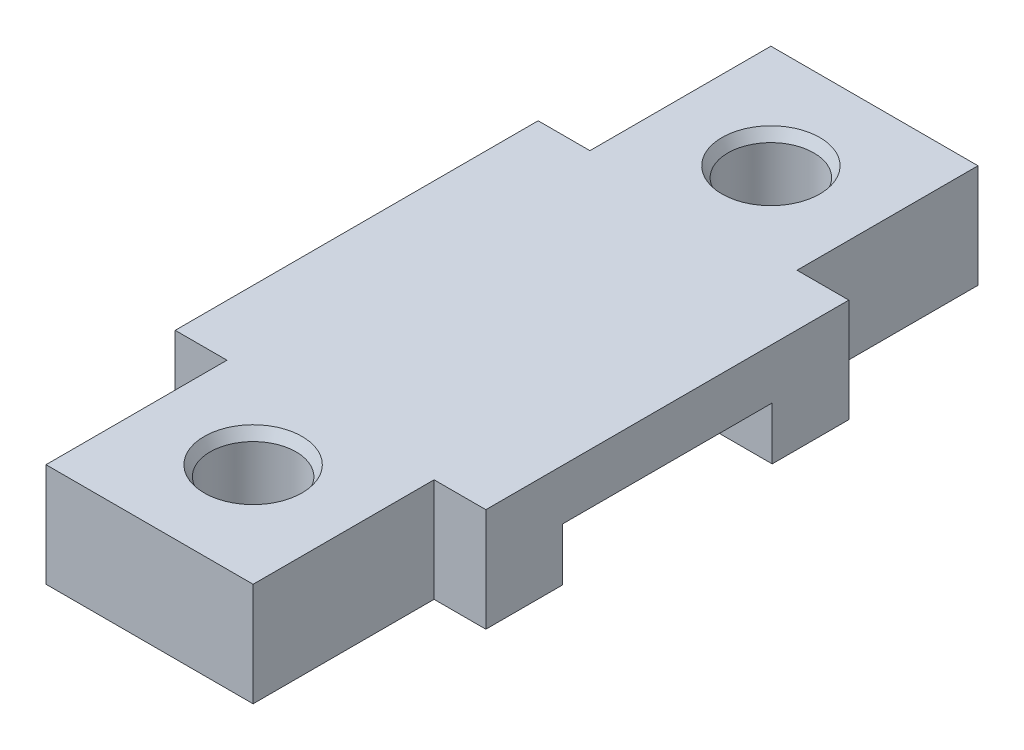
ISO-10303-21;
HEADER;
FILE_DESCRIPTION(('STEP AP214'),'2;1');
FILE_NAME('part.step','',(''),(''),'','','');
FILE_SCHEMA(('AUTOMOTIVE_DESIGN { 1 0 10303 214 1 1 1 1 }'));
ENDSEC;
DATA;
#1=APPLICATION_CONTEXT('core data for automotive mechanical design processes');
#2=APPLICATION_PROTOCOL_DEFINITION('international standard','automotive_design',2000,#1);
#3=PRODUCT_CONTEXT('',#1,'mechanical');
#4=PRODUCT('Part','Part','',(#3));
#5=PRODUCT_RELATED_PRODUCT_CATEGORY('part','',(#4));
#6=PRODUCT_DEFINITION_FORMATION('','',#4);
#7=PRODUCT_DEFINITION_CONTEXT('part definition',#1,'design');
#8=PRODUCT_DEFINITION('design','',#6,#7);
#9=PRODUCT_DEFINITION_SHAPE('','',#8);
#10=(LENGTH_UNIT() NAMED_UNIT(*) SI_UNIT(.MILLI.,.METRE.));
#11=(NAMED_UNIT(*) PLANE_ANGLE_UNIT() SI_UNIT($,.RADIAN.));
#12=(NAMED_UNIT(*) SI_UNIT($,.STERADIAN.) SOLID_ANGLE_UNIT());
#13=UNCERTAINTY_MEASURE_WITH_UNIT(LENGTH_MEASURE(1.E-05),#10,'distance_accuracy_value','');
#14=(GEOMETRIC_REPRESENTATION_CONTEXT(3) GLOBAL_UNCERTAINTY_ASSIGNED_CONTEXT((#13)) GLOBAL_UNIT_ASSIGNED_CONTEXT((#10,
#11,#12)) REPRESENTATION_CONTEXT('',''));
#15=CARTESIAN_POINT('',(0.,0.,0.));
#16=DIRECTION('',(0.,0.,1.));
#17=DIRECTION('',(1.,0.,0.));
#18=AXIS2_PLACEMENT_3D('',#15,#16,#17);
#19=CARTESIAN_POINT('',(-10.,10.,35.));
#20=DIRECTION('',(1.,0.,0.));
#21=DIRECTION('',(0.,0.,-1.));
#22=AXIS2_PLACEMENT_3D('',#19,#20,#21);
#23=PLANE('',#22);
#24=DIRECTION('',(0.,0.,1.));
#25=VECTOR('',#24,1.);
#26=CARTESIAN_POINT('',(-10.,10.,35.));
#27=LINE('',#26,#25);
#28=CARTESIAN_POINT('',(-10.,10.,17.525));
#29=VERTEX_POINT('',#28);
#30=CARTESIAN_POINT('',(-10.,10.,35.));
#31=VERTEX_POINT('',#30);
#32=EDGE_CURVE('E248',#29,#31,#27,.T.);
#33=ORIENTED_EDGE('',*,*,#32,.F.);
#34=DIRECTION('',(0.,-1.,0.));
#35=VECTOR('',#34,1.);
#36=CARTESIAN_POINT('',(-10.,10.,17.525));
#37=LINE('',#36,#35);
#38=CARTESIAN_POINT('',(-10.,0.,17.525));
#39=VERTEX_POINT('',#38);
#40=EDGE_CURVE('E49',#29,#39,#37,.T.);
#41=ORIENTED_EDGE('',*,*,#40,.T.);
#42=DIRECTION('',(0.,0.,1.));
#43=VECTOR('',#42,1.);
#44=CARTESIAN_POINT('',(-10.,0.,35.));
#45=LINE('',#44,#43);
#46=CARTESIAN_POINT('',(-10.,0.,35.));
#47=VERTEX_POINT('',#46);
#48=EDGE_CURVE('E158',#39,#47,#45,.T.);
#49=ORIENTED_EDGE('',*,*,#48,.T.);
#50=DIRECTION('',(0.,-1.,0.));
#51=VECTOR('',#50,1.);
#52=CARTESIAN_POINT('',(-10.,10.,35.));
#53=LINE('',#52,#51);
#54=EDGE_CURVE('E272',#31,#47,#53,.T.);
#55=ORIENTED_EDGE('',*,*,#54,.F.);
#56=EDGE_LOOP('',(#33,#41,#49,#55));
#57=FACE_BOUND('',#56,.T.);
#58=ADVANCED_FACE('F34',(#57),#23,.F.);
#59=CARTESIAN_POINT('',(9.99999999999999,10.,35.));
#60=DIRECTION('',(-1.,0.,0.));
#61=DIRECTION('',(0.,0.,1.));
#62=AXIS2_PLACEMENT_3D('',#59,#60,#61);
#63=PLANE('',#62);
#64=DIRECTION('',(0.,0.,-1.));
#65=VECTOR('',#64,1.);
#66=CARTESIAN_POINT('',(9.99999999999999,0.,35.));
#67=LINE('',#66,#65);
#68=CARTESIAN_POINT('',(9.99999999999999,0.,35.));
#69=VERTEX_POINT('',#68);
#70=CARTESIAN_POINT('',(9.99999999999999,0.,17.525));
#71=VERTEX_POINT('',#70);
#72=EDGE_CURVE('E57',#69,#71,#67,.T.);
#73=ORIENTED_EDGE('',*,*,#72,.T.);
#74=DIRECTION('',(0.,1.,0.));
#75=VECTOR('',#74,1.);
#76=CARTESIAN_POINT('',(9.99999999999999,10.,17.525));
#77=LINE('',#76,#75);
#78=CARTESIAN_POINT('',(9.99999999999999,10.,17.525));
#79=VERTEX_POINT('',#78);
#80=EDGE_CURVE('E230',#71,#79,#77,.T.);
#81=ORIENTED_EDGE('',*,*,#80,.T.);
#82=DIRECTION('',(0.,0.,-1.));
#83=VECTOR('',#82,1.);
#84=CARTESIAN_POINT('',(9.99999999999999,10.,35.));
#85=LINE('',#84,#83);
#86=CARTESIAN_POINT('',(9.99999999999999,10.,35.));
#87=VERTEX_POINT('',#86);
#88=EDGE_CURVE('E251',#87,#79,#85,.T.);
#89=ORIENTED_EDGE('',*,*,#88,.F.);
#90=DIRECTION('',(0.,-1.,0.));
#91=VECTOR('',#90,1.);
#92=CARTESIAN_POINT('',(9.99999999999999,10.,35.));
#93=LINE('',#92,#91);
#94=EDGE_CURVE('E270',#87,#69,#93,.T.);
#95=ORIENTED_EDGE('',*,*,#94,.T.);
#96=EDGE_LOOP('',(#73,#81,#89,#95));
#97=FACE_BOUND('',#96,.T.);
#98=ADVANCED_FACE('F344',(#97),#63,.F.);
#99=CARTESIAN_POINT('',(0.,0.,0.));
#100=DIRECTION('',(0.,1.,0.));
#101=DIRECTION('',(0.,0.,1.));
#102=AXIS2_PLACEMENT_3D('',#99,#100,#101);
#103=PLANE('',#102);
#104=CARTESIAN_POINT('',(0.,0.,25.));
#105=DIRECTION('',(0.,-1.,0.));
#106=DIRECTION('',(0.,0.,-1.));
#107=AXIS2_PLACEMENT_3D('',#104,#105,#106);
#108=CIRCLE('',#107,4.15);
#109=CARTESIAN_POINT('',(0.,0.,20.85));
#110=VERTEX_POINT('',#109);
#111=EDGE_CURVE('E236',#110,#110,#108,.T.);
#112=ORIENTED_EDGE('',*,*,#111,.F.);
#113=EDGE_LOOP('',(#112));
#114=FACE_BOUND('',#113,.T.);
#115=ORIENTED_EDGE('',*,*,#48,.F.);
#116=DIRECTION('',(1.,0.,0.));
#117=VECTOR('',#116,1.);
#118=CARTESIAN_POINT('',(-15.,0.,17.525));
#119=LINE('',#118,#117);
#120=CARTESIAN_POINT('',(-15.,0.,17.525));
#121=VERTEX_POINT('',#120);
#122=EDGE_CURVE('E211',#121,#39,#119,.T.);
#123=ORIENTED_EDGE('',*,*,#122,.F.);
#124=DIRECTION('',(0.,0.,-1.));
#125=VECTOR('',#124,1.);
#126=CARTESIAN_POINT('',(-15.,0.,10.125));
#127=LINE('',#126,#125);
#128=CARTESIAN_POINT('',(-15.,0.,10.125));
#129=VERTEX_POINT('',#128);
#130=EDGE_CURVE('E207',#121,#129,#127,.T.);
#131=ORIENTED_EDGE('',*,*,#130,.T.);
#132=DIRECTION('',(1.,0.,0.));
#133=VECTOR('',#132,1.);
#134=CARTESIAN_POINT('',(-10.,0.,10.125));
#135=LINE('',#134,#133);
#136=CARTESIAN_POINT('',(15.,0.,10.125));
#137=VERTEX_POINT('',#136);
#138=EDGE_CURVE('E238',#129,#137,#135,.T.);
#139=ORIENTED_EDGE('',*,*,#138,.T.);
#140=DIRECTION('',(0.,0.,-1.));
#141=VECTOR('',#140,1.);
#142=CARTESIAN_POINT('',(15.,0.,10.125));
#143=LINE('',#142,#141);
#144=CARTESIAN_POINT('',(15.,0.,17.525));
#145=VERTEX_POINT('',#144);
#146=EDGE_CURVE('E173',#145,#137,#143,.T.);
#147=ORIENTED_EDGE('',*,*,#146,.F.);
#148=EDGE_CURVE('E215',#71,#145,#119,.T.);
#149=ORIENTED_EDGE('',*,*,#148,.F.);
#150=ORIENTED_EDGE('',*,*,#72,.F.);
#151=DIRECTION('',(1.,0.,0.));
#152=VECTOR('',#151,1.);
#153=CARTESIAN_POINT('',(9.99999999999999,0.,35.));
#154=LINE('',#153,#152);
#155=EDGE_CURVE('E259',#47,#69,#154,.T.);
#156=ORIENTED_EDGE('',*,*,#155,.F.);
#157=EDGE_LOOP('',(#115,#123,#131,#139,#147,#149,#150,#156));
#158=FACE_BOUND('',#157,.T.);
#159=ADVANCED_FACE('F333',(#114,#158),#103,.F.);
#160=CARTESIAN_POINT('',(-10.,0.,-35.));
#161=VERTEX_POINT('',#160);
#162=CARTESIAN_POINT('',(-10.,0.,-17.525));
#163=VERTEX_POINT('',#162);
#164=EDGE_CURVE('E257',#161,#163,#45,.T.);
#165=ORIENTED_EDGE('',*,*,#164,.T.);
#166=DIRECTION('',(0.,1.,0.));
#167=VECTOR('',#166,1.);
#168=CARTESIAN_POINT('',(-10.,10.,-17.525));
#169=LINE('',#168,#167);
#170=CARTESIAN_POINT('',(-10.,10.,-17.525));
#171=VERTEX_POINT('',#170);
#172=EDGE_CURVE('E228',#163,#171,#169,.T.);
#173=ORIENTED_EDGE('',*,*,#172,.T.);
#174=CARTESIAN_POINT('',(-10.,10.,-35.));
#175=VERTEX_POINT('',#174);
#176=EDGE_CURVE('E244',#175,#171,#27,.T.);
#177=ORIENTED_EDGE('',*,*,#176,.F.);
#178=DIRECTION('',(0.,-1.,0.));
#179=VECTOR('',#178,1.);
#180=CARTESIAN_POINT('',(-10.,10.,-35.));
#181=LINE('',#180,#179);
#182=EDGE_CURVE('E256',#175,#161,#181,.T.);
#183=ORIENTED_EDGE('',*,*,#182,.T.);
#184=EDGE_LOOP('',(#165,#173,#177,#183));
#185=FACE_BOUND('',#184,.T.);
#186=ADVANCED_FACE('F352',(#185),#23,.F.);
#187=CARTESIAN_POINT('',(9.99999999999999,10.,35.));
#188=DIRECTION('',(0.,0.,-1.));
#189=DIRECTION('',(-1.,0.,0.));
#190=AXIS2_PLACEMENT_3D('',#187,#188,#189);
#191=PLANE('',#190);
#192=ORIENTED_EDGE('',*,*,#155,.T.);
#193=ORIENTED_EDGE('',*,*,#94,.F.);
#194=DIRECTION('',(1.,0.,0.));
#195=VECTOR('',#194,1.);
#196=CARTESIAN_POINT('',(9.99999999999999,10.,35.));
#197=LINE('',#196,#195);
#198=EDGE_CURVE('E247',#31,#87,#197,.T.);
#199=ORIENTED_EDGE('',*,*,#198,.F.);
#200=ORIENTED_EDGE('',*,*,#54,.T.);
#201=EDGE_LOOP('',(#192,#193,#199,#200));
#202=FACE_BOUND('',#201,.T.);
#203=ADVANCED_FACE('F341',(#202),#191,.F.);
#204=CARTESIAN_POINT('',(9.99999999999999,10.,-17.525));
#205=VERTEX_POINT('',#204);
#206=CARTESIAN_POINT('',(9.99999999999999,10.,-35.));
#207=VERTEX_POINT('',#206);
#208=EDGE_CURVE('E250',#205,#207,#85,.T.);
#209=ORIENTED_EDGE('',*,*,#208,.F.);
#210=DIRECTION('',(0.,-1.,0.));
#211=VECTOR('',#210,1.);
#212=CARTESIAN_POINT('',(9.99999999999999,10.,-17.525));
#213=LINE('',#212,#211);
#214=CARTESIAN_POINT('',(9.99999999999999,0.,-17.525));
#215=VERTEX_POINT('',#214);
#216=EDGE_CURVE('E214',#205,#215,#213,.T.);
#217=ORIENTED_EDGE('',*,*,#216,.T.);
#218=CARTESIAN_POINT('',(9.99999999999999,0.,-35.));
#219=VERTEX_POINT('',#218);
#220=EDGE_CURVE('E261',#215,#219,#67,.T.);
#221=ORIENTED_EDGE('',*,*,#220,.T.);
#222=DIRECTION('',(0.,-1.,0.));
#223=VECTOR('',#222,1.);
#224=CARTESIAN_POINT('',(9.99999999999999,10.,-35.));
#225=LINE('',#224,#223);
#226=EDGE_CURVE('E267',#207,#219,#225,.T.);
#227=ORIENTED_EDGE('',*,*,#226,.F.);
#228=EDGE_LOOP('',(#209,#217,#221,#227));
#229=FACE_BOUND('',#228,.T.);
#230=ADVANCED_FACE('F347',(#229),#63,.F.);
#231=CARTESIAN_POINT('',(9.99999999999999,10.,-35.));
#232=DIRECTION('',(0.,0.,1.));
#233=DIRECTION('',(1.,0.,0.));
#234=AXIS2_PLACEMENT_3D('',#231,#232,#233);
#235=PLANE('',#234);
#236=DIRECTION('',(-1.,0.,0.));
#237=VECTOR('',#236,1.);
#238=CARTESIAN_POINT('',(9.99999999999999,0.,-35.));
#239=LINE('',#238,#237);
#240=EDGE_CURVE('E263',#219,#161,#239,.T.);
#241=ORIENTED_EDGE('',*,*,#240,.T.);
#242=ORIENTED_EDGE('',*,*,#182,.F.);
#243=DIRECTION('',(-1.,0.,0.));
#244=VECTOR('',#243,1.);
#245=CARTESIAN_POINT('',(9.99999999999999,10.,-35.));
#246=LINE('',#245,#244);
#247=EDGE_CURVE('E254',#207,#175,#246,.T.);
#248=ORIENTED_EDGE('',*,*,#247,.F.);
#249=ORIENTED_EDGE('',*,*,#226,.T.);
#250=EDGE_LOOP('',(#241,#242,#248,#249));
#251=FACE_BOUND('',#250,.T.);
#252=ADVANCED_FACE('F296',(#251),#235,.F.);
#253=CARTESIAN_POINT('',(0.,10.,0.));
#254=DIRECTION('',(0.,1.,0.));
#255=DIRECTION('',(0.,0.,1.));
#256=AXIS2_PLACEMENT_3D('',#253,#254,#255);
#257=PLANE('',#256);
#258=CARTESIAN_POINT('',(0.,10.,-25.));
#259=DIRECTION('',(0.,1.,0.));
#260=DIRECTION('',(0.,0.,1.));
#261=AXIS2_PLACEMENT_3D('',#258,#259,#260);
#262=CIRCLE('',#261,4.72735026918962);
#263=CARTESIAN_POINT('',(0.,10.,-20.2726497308104));
#264=VERTEX_POINT('',#263);
#265=EDGE_CURVE('E278',#264,#264,#262,.F.);
#266=ORIENTED_EDGE('',*,*,#265,.T.);
#267=EDGE_LOOP('',(#266));
#268=FACE_BOUND('',#267,.T.);
#269=CARTESIAN_POINT('',(0.,10.,25.));
#270=DIRECTION('',(0.,1.,0.));
#271=DIRECTION('',(0.,0.,1.));
#272=AXIS2_PLACEMENT_3D('',#269,#270,#271);
#273=CIRCLE('',#272,4.72735026918962);
#274=CARTESIAN_POINT('',(0.,10.,29.7273502691896));
#275=VERTEX_POINT('',#274);
#276=EDGE_CURVE('E275',#275,#275,#273,.F.);
#277=ORIENTED_EDGE('',*,*,#276,.T.);
#278=EDGE_LOOP('',(#277));
#279=FACE_BOUND('',#278,.T.);
#280=ORIENTED_EDGE('',*,*,#176,.T.);
#281=DIRECTION('',(1.,0.,0.));
#282=VECTOR('',#281,1.);
#283=CARTESIAN_POINT('',(-15.,10.,-17.525));
#284=LINE('',#283,#282);
#285=CARTESIAN_POINT('',(-15.,10.,-17.525));
#286=VERTEX_POINT('',#285);
#287=EDGE_CURVE('E220',#286,#171,#284,.T.);
#288=ORIENTED_EDGE('',*,*,#287,.F.);
#289=DIRECTION('',(0.,0.,1.));
#290=VECTOR('',#289,1.);
#291=CARTESIAN_POINT('',(-15.,10.,17.525));
#292=LINE('',#291,#290);
#293=CARTESIAN_POINT('',(-15.,10.,17.525));
#294=VERTEX_POINT('',#293);
#295=EDGE_CURVE('E201',#286,#294,#292,.T.);
#296=ORIENTED_EDGE('',*,*,#295,.T.);
#297=DIRECTION('',(1.,0.,0.));
#298=VECTOR('',#297,1.);
#299=CARTESIAN_POINT('',(-15.,10.,17.525));
#300=LINE('',#299,#298);
#301=EDGE_CURVE('E216',#294,#29,#300,.T.);
#302=ORIENTED_EDGE('',*,*,#301,.T.);
#303=ORIENTED_EDGE('',*,*,#32,.T.);
#304=ORIENTED_EDGE('',*,*,#198,.T.);
#305=ORIENTED_EDGE('',*,*,#88,.T.);
#306=CARTESIAN_POINT('',(15.,10.,17.525));
#307=VERTEX_POINT('',#306);
#308=EDGE_CURVE('E219',#79,#307,#300,.T.);
#309=ORIENTED_EDGE('',*,*,#308,.T.);
#310=DIRECTION('',(0.,0.,1.));
#311=VECTOR('',#310,1.);
#312=CARTESIAN_POINT('',(15.,10.,17.525));
#313=LINE('',#312,#311);
#314=CARTESIAN_POINT('',(15.,10.,-17.525));
#315=VERTEX_POINT('',#314);
#316=EDGE_CURVE('E183',#315,#307,#313,.T.);
#317=ORIENTED_EDGE('',*,*,#316,.F.);
#318=EDGE_CURVE('E223',#205,#315,#284,.T.);
#319=ORIENTED_EDGE('',*,*,#318,.F.);
#320=ORIENTED_EDGE('',*,*,#208,.T.);
#321=ORIENTED_EDGE('',*,*,#247,.T.);
#322=EDGE_LOOP('',(#280,#288,#296,#302,#303,#304,#305,#309,#317,#319,#320,#321));
#323=FACE_BOUND('',#322,.T.);
#324=ADVANCED_FACE('F292',(#268,#279,#323),#257,.T.);
#325=CARTESIAN_POINT('',(0.,0.,-25.));
#326=DIRECTION('',(0.,-1.,0.));
#327=DIRECTION('',(0.,0.,-1.));
#328=AXIS2_PLACEMENT_3D('',#325,#326,#327);
#329=CIRCLE('',#328,4.15);
#330=CARTESIAN_POINT('',(0.,0.,-29.15));
#331=VERTEX_POINT('',#330);
#332=EDGE_CURVE('E233',#331,#331,#329,.T.);
#333=ORIENTED_EDGE('',*,*,#332,.F.);
#334=EDGE_LOOP('',(#333));
#335=FACE_BOUND('',#334,.T.);
#336=ORIENTED_EDGE('',*,*,#220,.F.);
#337=DIRECTION('',(1.,0.,0.));
#338=VECTOR('',#337,1.);
#339=CARTESIAN_POINT('',(-15.,0.,-17.525));
#340=LINE('',#339,#338);
#341=CARTESIAN_POINT('',(15.,0.,-17.525));
#342=VERTEX_POINT('',#341);
#343=EDGE_CURVE('E210',#215,#342,#340,.T.);
#344=ORIENTED_EDGE('',*,*,#343,.T.);
#345=DIRECTION('',(0.,0.,-1.));
#346=VECTOR('',#345,1.);
#347=CARTESIAN_POINT('',(15.,0.,-17.525));
#348=LINE('',#347,#346);
#349=CARTESIAN_POINT('',(15.,0.,-10.125));
#350=VERTEX_POINT('',#349);
#351=EDGE_CURVE('E177',#350,#342,#348,.T.);
#352=ORIENTED_EDGE('',*,*,#351,.F.);
#353=DIRECTION('',(1.,0.,0.));
#354=VECTOR('',#353,1.);
#355=CARTESIAN_POINT('',(-10.,0.,-10.125));
#356=LINE('',#355,#354);
#357=CARTESIAN_POINT('',(-15.,0.,-10.125));
#358=VERTEX_POINT('',#357);
#359=EDGE_CURVE('E241',#358,#350,#356,.T.);
#360=ORIENTED_EDGE('',*,*,#359,.F.);
#361=DIRECTION('',(0.,0.,-1.));
#362=VECTOR('',#361,1.);
#363=CARTESIAN_POINT('',(-15.,0.,-17.525));
#364=LINE('',#363,#362);
#365=CARTESIAN_POINT('',(-15.,0.,-17.525));
#366=VERTEX_POINT('',#365);
#367=EDGE_CURVE('E195',#358,#366,#364,.T.);
#368=ORIENTED_EDGE('',*,*,#367,.T.);
#369=EDGE_CURVE('E224',#366,#163,#340,.T.);
#370=ORIENTED_EDGE('',*,*,#369,.T.);
#371=ORIENTED_EDGE('',*,*,#164,.F.);
#372=ORIENTED_EDGE('',*,*,#240,.F.);
#373=EDGE_LOOP('',(#336,#344,#352,#360,#368,#370,#371,#372));
#374=FACE_BOUND('',#373,.T.);
#375=ADVANCED_FACE('F295',(#335,#374),#103,.F.);
#376=CARTESIAN_POINT('',(-10.,5.10000000000001,-10.125));
#377=DIRECTION('',(0.,1.,0.));
#378=DIRECTION('',(0.,0.,1.));
#379=AXIS2_PLACEMENT_3D('',#376,#377,#378);
#380=PLANE('',#379);
#381=DIRECTION('',(1.,0.,0.));
#382=VECTOR('',#381,1.);
#383=CARTESIAN_POINT('',(-10.,5.1,10.125));
#384=LINE('',#383,#382);
#385=CARTESIAN_POINT('',(-15.,5.1,10.125));
#386=VERTEX_POINT('',#385);
#387=CARTESIAN_POINT('',(15.,5.1,10.125));
#388=VERTEX_POINT('',#387);
#389=EDGE_CURVE('E148',#386,#388,#384,.T.);
#390=ORIENTED_EDGE('',*,*,#389,.F.);
#391=DIRECTION('',(0.,0.,-1.));
#392=VECTOR('',#391,1.);
#393=CARTESIAN_POINT('',(-15.,5.10000000000001,-10.125));
#394=LINE('',#393,#392);
#395=CARTESIAN_POINT('',(-15.,5.10000000000001,-10.125));
#396=VERTEX_POINT('',#395);
#397=EDGE_CURVE('E190',#386,#396,#394,.T.);
#398=ORIENTED_EDGE('',*,*,#397,.T.);
#399=DIRECTION('',(1.,0.,0.));
#400=VECTOR('',#399,1.);
#401=CARTESIAN_POINT('',(-10.,5.10000000000001,-10.125));
#402=LINE('',#401,#400);
#403=CARTESIAN_POINT('',(15.,5.10000000000001,-10.125));
#404=VERTEX_POINT('',#403);
#405=EDGE_CURVE('E159',#396,#404,#402,.T.);
#406=ORIENTED_EDGE('',*,*,#405,.T.);
#407=DIRECTION('',(0.,0.,-1.));
#408=VECTOR('',#407,1.);
#409=CARTESIAN_POINT('',(15.,5.10000000000001,-10.125));
#410=LINE('',#409,#408);
#411=EDGE_CURVE('E162',#388,#404,#410,.T.);
#412=ORIENTED_EDGE('',*,*,#411,.F.);
#413=EDGE_LOOP('',(#390,#398,#406,#412));
#414=FACE_BOUND('',#413,.T.);
#415=ADVANCED_FACE('F163',(#414),#380,.F.);
#416=CARTESIAN_POINT('',(-10.,5.1,10.125));
#417=DIRECTION('',(0.,0.,1.));
#418=DIRECTION('',(1.,0.,0.));
#419=AXIS2_PLACEMENT_3D('',#416,#417,#418);
#420=PLANE('',#419);
#421=ORIENTED_EDGE('',*,*,#138,.F.);
#422=DIRECTION('',(0.,1.,0.));
#423=VECTOR('',#422,1.);
#424=CARTESIAN_POINT('',(-15.,5.1,10.125));
#425=LINE('',#424,#423);
#426=EDGE_CURVE('E154',#129,#386,#425,.T.);
#427=ORIENTED_EDGE('',*,*,#426,.T.);
#428=ORIENTED_EDGE('',*,*,#389,.T.);
#429=DIRECTION('',(0.,1.,0.));
#430=VECTOR('',#429,1.);
#431=CARTESIAN_POINT('',(15.,5.1,10.125));
#432=LINE('',#431,#430);
#433=EDGE_CURVE('E152',#137,#388,#432,.T.);
#434=ORIENTED_EDGE('',*,*,#433,.F.);
#435=EDGE_LOOP('',(#421,#427,#428,#434));
#436=FACE_BOUND('',#435,.T.);
#437=ADVANCED_FACE('F150',(#436),#420,.F.);
#438=CARTESIAN_POINT('',(-10.,5.10000000000001,-10.125));
#439=DIRECTION('',(0.,0.,-1.));
#440=DIRECTION('',(0.,1.,0.));
#441=AXIS2_PLACEMENT_3D('',#438,#439,#440);
#442=PLANE('',#441);
#443=ORIENTED_EDGE('',*,*,#405,.F.);
#444=DIRECTION('',(0.,-1.,0.));
#445=VECTOR('',#444,1.);
#446=CARTESIAN_POINT('',(-15.,0.,-10.125));
#447=LINE('',#446,#445);
#448=EDGE_CURVE('E192',#396,#358,#447,.T.);
#449=ORIENTED_EDGE('',*,*,#448,.T.);
#450=ORIENTED_EDGE('',*,*,#359,.T.);
#451=DIRECTION('',(0.,-1.,0.));
#452=VECTOR('',#451,1.);
#453=CARTESIAN_POINT('',(15.,0.,-10.125));
#454=LINE('',#453,#452);
#455=EDGE_CURVE('E167',#404,#350,#454,.T.);
#456=ORIENTED_EDGE('',*,*,#455,.F.);
#457=EDGE_LOOP('',(#443,#449,#450,#456));
#458=FACE_BOUND('',#457,.T.);
#459=ADVANCED_FACE('F318',(#458),#442,.F.);
#460=CARTESIAN_POINT('',(0.,10.,25.));
#461=DIRECTION('',(0.,-1.,0.));
#462=DIRECTION('',(0.,0.,-1.));
#463=AXIS2_PLACEMENT_3D('',#460,#461,#462);
#464=CYLINDRICAL_SURFACE('',#463,4.15);
#465=CARTESIAN_POINT('',(0.,9.,25.));
#466=DIRECTION('',(0.,1.,0.));
#467=DIRECTION('',(0.,0.,1.));
#468=AXIS2_PLACEMENT_3D('',#465,#466,#467);
#469=CIRCLE('',#468,4.15);
#470=CARTESIAN_POINT('',(0.,9.,29.15));
#471=VERTEX_POINT('',#470);
#472=EDGE_CURVE('E11',#471,#471,#469,.T.);
#473=ORIENTED_EDGE('',*,*,#472,.T.);
#474=EDGE_LOOP('',(#473));
#475=FACE_BOUND('',#474,.T.);
#476=ORIENTED_EDGE('',*,*,#111,.T.);
#477=EDGE_LOOP('',(#476));
#478=FACE_BOUND('',#477,.T.);
#479=ADVANCED_FACE('F451',(#475,#478),#464,.F.);
#480=CARTESIAN_POINT('',(0.,10.,-25.));
#481=DIRECTION('',(0.,-1.,0.));
#482=DIRECTION('',(0.,0.,-1.));
#483=AXIS2_PLACEMENT_3D('',#480,#481,#482);
#484=CYLINDRICAL_SURFACE('',#483,4.15);
#485=CARTESIAN_POINT('',(0.,9.,-25.));
#486=DIRECTION('',(0.,1.,0.));
#487=DIRECTION('',(0.,0.,1.));
#488=AXIS2_PLACEMENT_3D('',#485,#486,#487);
#489=CIRCLE('',#488,4.15);
#490=CARTESIAN_POINT('',(0.,9.,-20.85));
#491=VERTEX_POINT('',#490);
#492=EDGE_CURVE('E42',#491,#491,#489,.T.);
#493=ORIENTED_EDGE('',*,*,#492,.T.);
#494=EDGE_LOOP('',(#493));
#495=FACE_BOUND('',#494,.T.);
#496=ORIENTED_EDGE('',*,*,#332,.T.);
#497=EDGE_LOOP('',(#496));
#498=FACE_BOUND('',#497,.T.);
#499=ADVANCED_FACE('F283',(#495,#498),#484,.F.);
#500=CARTESIAN_POINT('',(15.,0.,0.));
#501=DIRECTION('',(-1.,0.,0.));
#502=DIRECTION('',(0.,0.,1.));
#503=AXIS2_PLACEMENT_3D('',#500,#501,#502);
#504=PLANE('',#503);
#505=ORIENTED_EDGE('',*,*,#433,.T.);
#506=ORIENTED_EDGE('',*,*,#411,.T.);
#507=ORIENTED_EDGE('',*,*,#455,.T.);
#508=ORIENTED_EDGE('',*,*,#351,.T.);
#509=DIRECTION('',(0.,1.,0.));
#510=VECTOR('',#509,1.);
#511=CARTESIAN_POINT('',(15.,10.,-17.525));
#512=LINE('',#511,#510);
#513=EDGE_CURVE('E180',#342,#315,#512,.T.);
#514=ORIENTED_EDGE('',*,*,#513,.T.);
#515=ORIENTED_EDGE('',*,*,#316,.T.);
#516=DIRECTION('',(0.,-1.,0.));
#517=VECTOR('',#516,1.);
#518=CARTESIAN_POINT('',(15.,0.,17.525));
#519=LINE('',#518,#517);
#520=EDGE_CURVE('E186',#307,#145,#519,.T.);
#521=ORIENTED_EDGE('',*,*,#520,.T.);
#522=ORIENTED_EDGE('',*,*,#146,.T.);
#523=EDGE_LOOP('',(#505,#506,#507,#508,#514,#515,#521,#522));
#524=FACE_BOUND('',#523,.T.);
#525=ADVANCED_FACE('F170',(#524),#504,.F.);
#526=CARTESIAN_POINT('',(-15.,10.,-17.525));
#527=DIRECTION('',(0.,0.,-1.));
#528=DIRECTION('',(-1.,0.,0.));
#529=AXIS2_PLACEMENT_3D('',#526,#527,#528);
#530=PLANE('',#529);
#531=ORIENTED_EDGE('',*,*,#216,.F.);
#532=ORIENTED_EDGE('',*,*,#318,.T.);
#533=ORIENTED_EDGE('',*,*,#513,.F.);
#534=ORIENTED_EDGE('',*,*,#343,.F.);
#535=EDGE_LOOP('',(#531,#532,#533,#534));
#536=FACE_BOUND('',#535,.T.);
#537=ADVANCED_FACE('F324',(#536),#530,.T.);
#538=CARTESIAN_POINT('',(-15.,0.,17.525));
#539=DIRECTION('',(0.,0.,1.));
#540=DIRECTION('',(1.,0.,0.));
#541=AXIS2_PLACEMENT_3D('',#538,#539,#540);
#542=PLANE('',#541);
#543=ORIENTED_EDGE('',*,*,#80,.F.);
#544=ORIENTED_EDGE('',*,*,#148,.T.);
#545=ORIENTED_EDGE('',*,*,#520,.F.);
#546=ORIENTED_EDGE('',*,*,#308,.F.);
#547=EDGE_LOOP('',(#543,#544,#545,#546));
#548=FACE_BOUND('',#547,.T.);
#549=ADVANCED_FACE('F330',(#548),#542,.T.);
#550=ORIENTED_EDGE('',*,*,#40,.F.);
#551=ORIENTED_EDGE('',*,*,#301,.F.);
#552=DIRECTION('',(0.,-1.,0.));
#553=VECTOR('',#552,1.);
#554=CARTESIAN_POINT('',(-15.,0.,17.525));
#555=LINE('',#554,#553);
#556=EDGE_CURVE('E204',#294,#121,#555,.T.);
#557=ORIENTED_EDGE('',*,*,#556,.T.);
#558=ORIENTED_EDGE('',*,*,#122,.T.);
#559=EDGE_LOOP('',(#550,#551,#557,#558));
#560=FACE_BOUND('',#559,.T.);
#561=ADVANCED_FACE('F338',(#560),#542,.T.);
#562=ORIENTED_EDGE('',*,*,#172,.F.);
#563=ORIENTED_EDGE('',*,*,#369,.F.);
#564=DIRECTION('',(0.,1.,0.));
#565=VECTOR('',#564,1.);
#566=CARTESIAN_POINT('',(-15.,10.,-17.525));
#567=LINE('',#566,#565);
#568=EDGE_CURVE('E198',#366,#286,#567,.T.);
#569=ORIENTED_EDGE('',*,*,#568,.T.);
#570=ORIENTED_EDGE('',*,*,#287,.T.);
#571=EDGE_LOOP('',(#562,#563,#569,#570));
#572=FACE_BOUND('',#571,.T.);
#573=ADVANCED_FACE('F307',(#572),#530,.T.);
#574=CARTESIAN_POINT('',(-15.,0.,0.));
#575=DIRECTION('',(-1.,0.,0.));
#576=DIRECTION('',(0.,0.,1.));
#577=AXIS2_PLACEMENT_3D('',#574,#575,#576);
#578=PLANE('',#577);
#579=ORIENTED_EDGE('',*,*,#426,.F.);
#580=ORIENTED_EDGE('',*,*,#130,.F.);
#581=ORIENTED_EDGE('',*,*,#556,.F.);
#582=ORIENTED_EDGE('',*,*,#295,.F.);
#583=ORIENTED_EDGE('',*,*,#568,.F.);
#584=ORIENTED_EDGE('',*,*,#367,.F.);
#585=ORIENTED_EDGE('',*,*,#448,.F.);
#586=ORIENTED_EDGE('',*,*,#397,.F.);
#587=EDGE_LOOP('',(#579,#580,#581,#582,#583,#584,#585,#586));
#588=FACE_BOUND('',#587,.T.);
#589=ADVANCED_FACE('F289',(#588),#578,.T.);
#590=CARTESIAN_POINT('',(0.,10.,-25.));
#591=DIRECTION('',(0.,1.,0.));
#592=DIRECTION('',(0.,0.,1.));
#593=AXIS2_PLACEMENT_3D('',#590,#591,#592);
#594=CONICAL_SURFACE('',#593,4.72735026918962,0.523598775598294);
#595=ORIENTED_EDGE('',*,*,#492,.F.);
#596=EDGE_LOOP('',(#595));
#597=FACE_BOUND('',#596,.T.);
#598=ORIENTED_EDGE('',*,*,#265,.F.);
#599=EDGE_LOOP('',(#598));
#600=FACE_BOUND('',#599,.T.);
#601=ADVANCED_FACE('F286',(#597,#600),#594,.F.);
#602=CARTESIAN_POINT('',(0.,10.,25.));
#603=DIRECTION('',(0.,1.,0.));
#604=DIRECTION('',(0.,0.,1.));
#605=AXIS2_PLACEMENT_3D('',#602,#603,#604);
#606=CONICAL_SURFACE('',#605,4.72735026918962,0.523598775598294);
#607=ORIENTED_EDGE('',*,*,#472,.F.);
#608=EDGE_LOOP('',(#607));
#609=FACE_BOUND('',#608,.T.);
#610=ORIENTED_EDGE('',*,*,#276,.F.);
#611=EDGE_LOOP('',(#610));
#612=FACE_BOUND('',#611,.T.);
#613=ADVANCED_FACE('F36',(#609,#612),#606,.F.);
#614=CLOSED_SHELL('',(#58,#98,#159,#186,#203,#230,#252,#324,#375,#415,#437,#459,#479,#499,#525,
#537,#549,#561,#573,#589,#601,#613));
#615=MANIFOLD_SOLID_BREP('B2',#614);
#616=ADVANCED_BREP_SHAPE_REPRESENTATION('',(#18,#615),#14);
#617=SHAPE_DEFINITION_REPRESENTATION(#9,#616);
ENDSEC;
END-ISO-10303-21;
